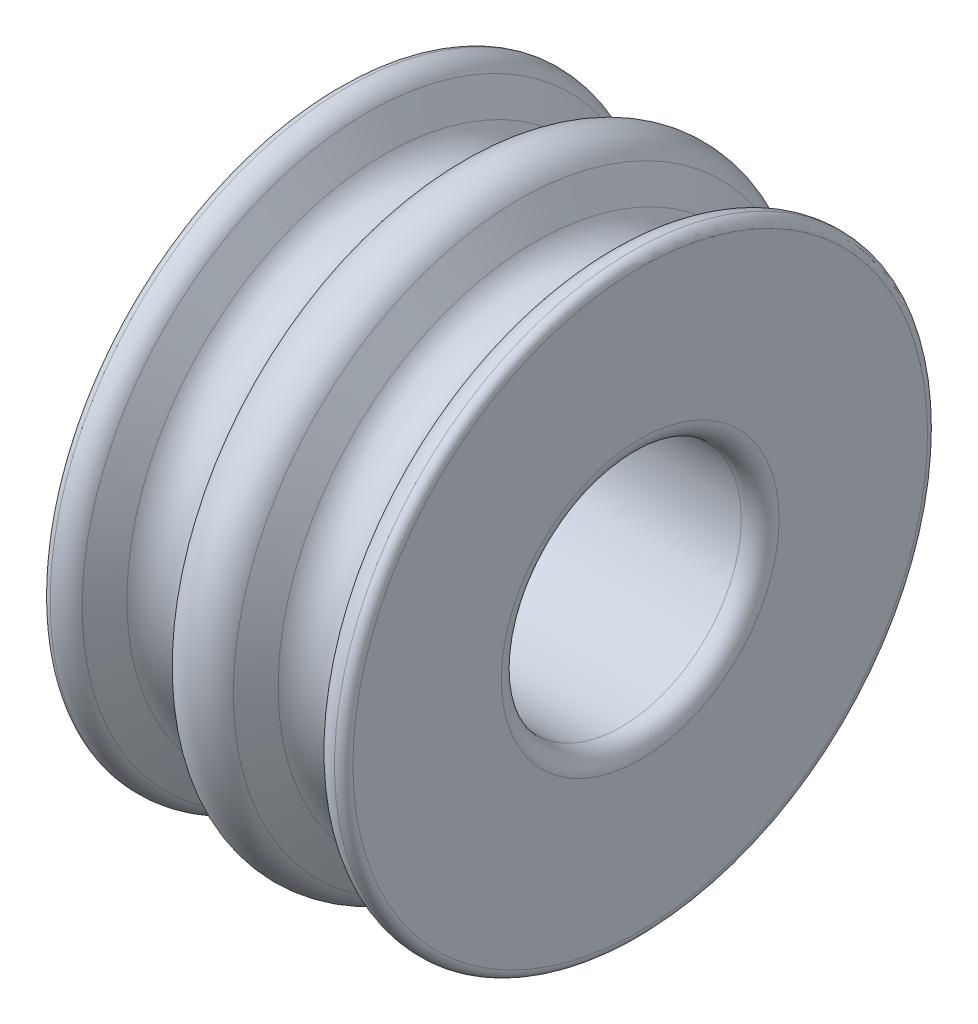
ISO-10303-21;
HEADER;
FILE_DESCRIPTION(('STEP AP214'),'2;1');
FILE_NAME('part.step','',(''),(''),'','','');
FILE_SCHEMA(('AUTOMOTIVE_DESIGN { 1 0 10303 214 1 1 1 1 }'));
ENDSEC;
DATA;
#1=APPLICATION_CONTEXT('core data for automotive mechanical design processes');
#2=APPLICATION_PROTOCOL_DEFINITION('international standard','automotive_design',2000,#1);
#3=PRODUCT_CONTEXT('',#1,'mechanical');
#4=PRODUCT('Part','Part','',(#3));
#5=PRODUCT_RELATED_PRODUCT_CATEGORY('part','',(#4));
#6=PRODUCT_DEFINITION_FORMATION('','',#4);
#7=PRODUCT_DEFINITION_CONTEXT('part definition',#1,'design');
#8=PRODUCT_DEFINITION('design','',#6,#7);
#9=PRODUCT_DEFINITION_SHAPE('','',#8);
#10=(LENGTH_UNIT() NAMED_UNIT(*) SI_UNIT(.MILLI.,.METRE.));
#11=(NAMED_UNIT(*) PLANE_ANGLE_UNIT() SI_UNIT($,.RADIAN.));
#12=(NAMED_UNIT(*) SI_UNIT($,.STERADIAN.) SOLID_ANGLE_UNIT());
#13=UNCERTAINTY_MEASURE_WITH_UNIT(LENGTH_MEASURE(1.E-05),#10,'distance_accuracy_value','');
#14=(GEOMETRIC_REPRESENTATION_CONTEXT(3) GLOBAL_UNCERTAINTY_ASSIGNED_CONTEXT((#13)) GLOBAL_UNIT_ASSIGNED_CONTEXT((#10,
#11,#12)) REPRESENTATION_CONTEXT('',''));
#15=CARTESIAN_POINT('',(0.,0.,0.));
#16=DIRECTION('',(0.,0.,1.));
#17=DIRECTION('',(1.,0.,0.));
#18=AXIS2_PLACEMENT_3D('',#15,#16,#17);
#19=CARTESIAN_POINT('',(0.,0.,0.));
#20=DIRECTION('',(1.,0.,0.));
#21=DIRECTION('',(0.,0.,-1.));
#22=AXIS2_PLACEMENT_3D('',#19,#20,#21);
#23=TOROIDAL_SURFACE('',#22,14.1925947136558,1.81781012862925);
#24=CARTESIAN_POINT('',(1.57426975064959,0.,0.));
#25=DIRECTION('',(1.,0.,0.));
#26=DIRECTION('',(0.,0.,-1.));
#27=AXIS2_PLACEMENT_3D('',#24,#25,#26);
#28=CIRCLE('',#27,15.1014997779704);
#29=CARTESIAN_POINT('',(1.57426975064959,0.,-15.1014997779704));
#30=VERTEX_POINT('',#29);
#31=EDGE_CURVE('E105',#30,#30,#28,.T.);
#32=ORIENTED_EDGE('',*,*,#31,.F.);
#33=EDGE_LOOP('',(#32));
#34=FACE_BOUND('',#33,.T.);
#35=CARTESIAN_POINT('',(-1.57426975064959,0.,0.));
#36=DIRECTION('',(1.,0.,0.));
#37=DIRECTION('',(0.,0.,-1.));
#38=AXIS2_PLACEMENT_3D('',#35,#36,#37);
#39=CIRCLE('',#38,15.1014997779704);
#40=CARTESIAN_POINT('',(-1.57426975064959,0.,-15.1014997779704));
#41=VERTEX_POINT('',#40);
#42=EDGE_CURVE('E61',#41,#41,#39,.T.);
#43=ORIENTED_EDGE('',*,*,#42,.T.);
#44=EDGE_LOOP('',(#43));
#45=FACE_BOUND('',#44,.T.);
#46=ADVANCED_FACE('F37',(#34,#45),#23,.T.);
#47=CARTESIAN_POINT('',(-2.44116209087946,0.,0.));
#48=DIRECTION('',(1.,0.,0.));
#49=DIRECTION('',(0.,0.,-1.));
#50=AXIS2_PLACEMENT_3D('',#47,#48,#49);
#51=CONICAL_SURFACE('',#50,13.5999982,1.0471975511966);
#52=ORIENTED_EDGE('',*,*,#42,.F.);
#53=EDGE_LOOP('',(#52));
#54=FACE_BOUND('',#53,.T.);
#55=CARTESIAN_POINT('',(-2.44116209087946,0.,0.));
#56=DIRECTION('',(1.,0.,0.));
#57=DIRECTION('',(0.,0.,-1.));
#58=AXIS2_PLACEMENT_3D('',#55,#56,#57);
#59=CIRCLE('',#58,13.5999982);
#60=CARTESIAN_POINT('',(-2.44116209087946,0.,-13.5999982));
#61=VERTEX_POINT('',#60);
#62=EDGE_CURVE('E65',#61,#61,#59,.T.);
#63=ORIENTED_EDGE('',*,*,#62,.T.);
#64=EDGE_LOOP('',(#63));
#65=FACE_BOUND('',#64,.T.);
#66=ADVANCED_FACE('F115',(#54,#65),#51,.T.);
#67=CARTESIAN_POINT('',(-4.0000047,0.,0.));
#68=DIRECTION('',(1.,0.,0.));
#69=DIRECTION('',(0.,0.,-1.));
#70=AXIS2_PLACEMENT_3D('',#67,#68,#69);
#71=TOROIDAL_SURFACE('',#70,14.4999964,1.7999964);
#72=ORIENTED_EDGE('',*,*,#62,.F.);
#73=EDGE_LOOP('',(#72));
#74=FACE_BOUND('',#73,.T.);
#75=CARTESIAN_POINT('',(-5.55884730912053,0.,0.));
#76=DIRECTION('',(1.,0.,0.));
#77=DIRECTION('',(0.,0.,-1.));
#78=AXIS2_PLACEMENT_3D('',#75,#76,#77);
#79=CIRCLE('',#78,13.5999982);
#80=CARTESIAN_POINT('',(-5.55884730912053,0.,-13.5999982));
#81=VERTEX_POINT('',#80);
#82=EDGE_CURVE('E69',#81,#81,#79,.T.);
#83=ORIENTED_EDGE('',*,*,#82,.T.);
#84=EDGE_LOOP('',(#83));
#85=FACE_BOUND('',#84,.T.);
#86=ADVANCED_FACE('F121',(#74,#85),#71,.F.);
#87=CARTESIAN_POINT('',(-6.4257396493504,0.,0.));
#88=DIRECTION('',(-1.,0.,0.));
#89=DIRECTION('',(0.,0.,1.));
#90=AXIS2_PLACEMENT_3D('',#87,#88,#89);
#91=CONICAL_SURFACE('',#90,15.1014997779704,1.0471975511966);
#92=ORIENTED_EDGE('',*,*,#82,.F.);
#93=EDGE_LOOP('',(#92));
#94=FACE_BOUND('',#93,.T.);
#95=CARTESIAN_POINT('',(-6.4257396493504,0.,0.));
#96=DIRECTION('',(1.,0.,0.));
#97=DIRECTION('',(0.,0.,-1.));
#98=AXIS2_PLACEMENT_3D('',#95,#96,#97);
#99=CIRCLE('',#98,15.1014997779704);
#100=CARTESIAN_POINT('',(-6.4257396493504,0.,-15.1014997779704));
#101=VERTEX_POINT('',#100);
#102=EDGE_CURVE('E73',#101,#101,#99,.T.);
#103=ORIENTED_EDGE('',*,*,#102,.T.);
#104=EDGE_LOOP('',(#103));
#105=FACE_BOUND('',#104,.T.);
#106=ADVANCED_FACE('F127',(#94,#105),#91,.T.);
#107=CARTESIAN_POINT('',(-7.46496805543077,0.,0.));
#108=DIRECTION('',(1.,0.,0.));
#109=DIRECTION('',(0.,0.,-1.));
#110=AXIS2_PLACEMENT_3D('',#107,#108,#109);
#111=TOROIDAL_SURFACE('',#110,14.5015009779704,1.19999760000001);
#112=ORIENTED_EDGE('',*,*,#102,.F.);
#113=EDGE_LOOP('',(#112));
#114=FACE_BOUND('',#113,.T.);
#115=CARTESIAN_POINT('',(-7.52504064612088,0.,0.));
#116=DIRECTION('',(1.,0.,0.));
#117=DIRECTION('',(0.,0.,-1.));
#118=AXIS2_PLACEMENT_3D('',#115,#116,#117);
#119=CIRCLE('',#118,15.699994);
#120=CARTESIAN_POINT('',(-7.52504064612088,0.,-15.699994));
#121=VERTEX_POINT('',#120);
#122=EDGE_CURVE('E77',#121,#121,#119,.T.);
#123=ORIENTED_EDGE('',*,*,#122,.T.);
#124=EDGE_LOOP('',(#123));
#125=FACE_BOUND('',#124,.T.);
#126=ADVANCED_FACE('F133',(#114,#125),#111,.T.);
#127=CARTESIAN_POINT('',(-7.5000104,0.,0.));
#128=DIRECTION('',(1.,0.,0.));
#129=DIRECTION('',(0.,0.,-1.));
#130=AXIS2_PLACEMENT_3D('',#127,#128,#129);
#131=TOROIDAL_SURFACE('',#130,15.2006219074877,0.499999);
#132=ORIENTED_EDGE('',*,*,#122,.F.);
#133=EDGE_LOOP('',(#132));
#134=FACE_BOUND('',#133,.T.);
#135=CARTESIAN_POINT('',(-8.0000094,0.,0.));
#136=DIRECTION('',(1.,0.,0.));
#137=DIRECTION('',(0.,0.,-1.));
#138=AXIS2_PLACEMENT_3D('',#135,#136,#137);
#139=CIRCLE('',#138,15.2006219074877);
#140=CARTESIAN_POINT('',(-8.0000094,0.,-15.2006219074877));
#141=VERTEX_POINT('',#140);
#142=EDGE_CURVE('E81',#141,#141,#139,.T.);
#143=ORIENTED_EDGE('',*,*,#142,.T.);
#144=EDGE_LOOP('',(#143));
#145=FACE_BOUND('',#144,.T.);
#146=ADVANCED_FACE('F139',(#134,#145),#131,.T.);
#147=CARTESIAN_POINT('',(-8.0000094,0.,0.));
#148=DIRECTION('',(1.,0.,0.));
#149=DIRECTION('',(0.,0.,-1.));
#150=AXIS2_PLACEMENT_3D('',#147,#148,#149);
#151=PLANE('',#150);
#152=CARTESIAN_POINT('',(-8.0000094,0.,0.));
#153=DIRECTION('',(1.,0.,0.));
#154=DIRECTION('',(0.,0.,-1.));
#155=AXIS2_PLACEMENT_3D('',#152,#153,#154);
#156=CIRCLE('',#155,7.350000032);
#157=CARTESIAN_POINT('',(-8.0000094,0.,-7.350000032));
#158=VERTEX_POINT('',#157);
#159=EDGE_CURVE('E55',#158,#158,#156,.T.);
#160=ORIENTED_EDGE('',*,*,#159,.T.);
#161=EDGE_LOOP('',(#160));
#162=FACE_BOUND('',#161,.T.);
#163=ORIENTED_EDGE('',*,*,#142,.F.);
#164=EDGE_LOOP('',(#163));
#165=FACE_BOUND('',#164,.T.);
#166=ADVANCED_FACE('F145',(#162,#165),#151,.F.);
#167=CARTESIAN_POINT('',(8.0000094,0.,0.));
#168=DIRECTION('',(1.,0.,0.));
#169=DIRECTION('',(0.,0.,-1.));
#170=AXIS2_PLACEMENT_3D('',#167,#168,#169);
#171=PLANE('',#170);
#172=CARTESIAN_POINT('',(8.0000094,0.,0.));
#173=DIRECTION('',(1.,0.,0.));
#174=DIRECTION('',(0.,0.,-1.));
#175=AXIS2_PLACEMENT_3D('',#172,#173,#174);
#176=CIRCLE('',#175,7.350000032);
#177=CARTESIAN_POINT('',(8.0000094,0.,-7.350000032));
#178=VERTEX_POINT('',#177);
#179=EDGE_CURVE('E10',#178,#178,#176,.F.);
#180=ORIENTED_EDGE('',*,*,#179,.T.);
#181=EDGE_LOOP('',(#180));
#182=FACE_BOUND('',#181,.T.);
#183=CARTESIAN_POINT('',(8.0000094,0.,0.));
#184=DIRECTION('',(1.,0.,0.));
#185=DIRECTION('',(0.,0.,-1.));
#186=AXIS2_PLACEMENT_3D('',#183,#184,#185);
#187=CIRCLE('',#186,15.2006219074877);
#188=CARTESIAN_POINT('',(8.0000094,0.,-15.2006219074877));
#189=VERTEX_POINT('',#188);
#190=EDGE_CURVE('E85',#189,#189,#187,.T.);
#191=ORIENTED_EDGE('',*,*,#190,.T.);
#192=EDGE_LOOP('',(#191));
#193=FACE_BOUND('',#192,.T.);
#194=ADVANCED_FACE('F150',(#182,#193),#171,.T.);
#195=CARTESIAN_POINT('',(7.5000104,0.,0.));
#196=DIRECTION('',(1.,0.,0.));
#197=DIRECTION('',(0.,0.,-1.));
#198=AXIS2_PLACEMENT_3D('',#195,#196,#197);
#199=TOROIDAL_SURFACE('',#198,15.2006219074877,0.499999);
#200=CARTESIAN_POINT('',(7.52504064612088,0.,0.));
#201=DIRECTION('',(1.,0.,0.));
#202=DIRECTION('',(0.,0.,-1.));
#203=AXIS2_PLACEMENT_3D('',#200,#201,#202);
#204=CIRCLE('',#203,15.699994);
#205=CARTESIAN_POINT('',(7.52504064612088,0.,-15.699994));
#206=VERTEX_POINT('',#205);
#207=EDGE_CURVE('E89',#206,#206,#204,.T.);
#208=ORIENTED_EDGE('',*,*,#207,.T.);
#209=EDGE_LOOP('',(#208));
#210=FACE_BOUND('',#209,.T.);
#211=ORIENTED_EDGE('',*,*,#190,.F.);
#212=EDGE_LOOP('',(#211));
#213=FACE_BOUND('',#212,.T.);
#214=ADVANCED_FACE('F156',(#210,#213),#199,.T.);
#215=CARTESIAN_POINT('',(7.46496805543077,0.,0.));
#216=DIRECTION('',(1.,0.,0.));
#217=DIRECTION('',(0.,0.,-1.));
#218=AXIS2_PLACEMENT_3D('',#215,#216,#217);
#219=TOROIDAL_SURFACE('',#218,14.5015009779704,1.1999976);
#220=CARTESIAN_POINT('',(6.42573964935041,0.,0.));
#221=DIRECTION('',(1.,0.,0.));
#222=DIRECTION('',(0.,0.,-1.));
#223=AXIS2_PLACEMENT_3D('',#220,#221,#222);
#224=CIRCLE('',#223,15.1014997779704);
#225=CARTESIAN_POINT('',(6.42573964935041,0.,-15.1014997779704));
#226=VERTEX_POINT('',#225);
#227=EDGE_CURVE('E93',#226,#226,#224,.T.);
#228=ORIENTED_EDGE('',*,*,#227,.T.);
#229=EDGE_LOOP('',(#228));
#230=FACE_BOUND('',#229,.T.);
#231=ORIENTED_EDGE('',*,*,#207,.F.);
#232=EDGE_LOOP('',(#231));
#233=FACE_BOUND('',#232,.T.);
#234=ADVANCED_FACE('F184',(#230,#233),#219,.T.);
#235=CARTESIAN_POINT('',(6.42573964935041,0.,0.));
#236=DIRECTION('',(1.,0.,0.));
#237=DIRECTION('',(0.,0.,-1.));
#238=AXIS2_PLACEMENT_3D('',#235,#236,#237);
#239=CONICAL_SURFACE('',#238,15.1014997779704,1.0471975511966);
#240=CARTESIAN_POINT('',(5.55884730912054,0.,0.));
#241=DIRECTION('',(1.,0.,0.));
#242=DIRECTION('',(0.,0.,-1.));
#243=AXIS2_PLACEMENT_3D('',#240,#241,#242);
#244=CIRCLE('',#243,13.5999982);
#245=CARTESIAN_POINT('',(5.55884730912054,0.,-13.5999982));
#246=VERTEX_POINT('',#245);
#247=EDGE_CURVE('E97',#246,#246,#244,.T.);
#248=ORIENTED_EDGE('',*,*,#247,.T.);
#249=EDGE_LOOP('',(#248));
#250=FACE_BOUND('',#249,.T.);
#251=ORIENTED_EDGE('',*,*,#227,.F.);
#252=EDGE_LOOP('',(#251));
#253=FACE_BOUND('',#252,.T.);
#254=ADVANCED_FACE('F180',(#250,#253),#239,.T.);
#255=CARTESIAN_POINT('',(4.0000047,0.,0.));
#256=DIRECTION('',(1.,0.,0.));
#257=DIRECTION('',(0.,0.,-1.));
#258=AXIS2_PLACEMENT_3D('',#255,#256,#257);
#259=TOROIDAL_SURFACE('',#258,14.4999964,1.7999964);
#260=CARTESIAN_POINT('',(2.44116209087946,0.,0.));
#261=DIRECTION('',(1.,0.,0.));
#262=DIRECTION('',(0.,0.,-1.));
#263=AXIS2_PLACEMENT_3D('',#260,#261,#262);
#264=CIRCLE('',#263,13.5999982);
#265=CARTESIAN_POINT('',(2.44116209087946,0.,-13.5999982));
#266=VERTEX_POINT('',#265);
#267=EDGE_CURVE('E101',#266,#266,#264,.T.);
#268=ORIENTED_EDGE('',*,*,#267,.T.);
#269=EDGE_LOOP('',(#268));
#270=FACE_BOUND('',#269,.T.);
#271=ORIENTED_EDGE('',*,*,#247,.F.);
#272=EDGE_LOOP('',(#271));
#273=FACE_BOUND('',#272,.T.);
#274=ADVANCED_FACE('F174',(#270,#273),#259,.F.);
#275=CARTESIAN_POINT('',(2.44116209087946,0.,0.));
#276=DIRECTION('',(-1.,0.,0.));
#277=DIRECTION('',(0.,0.,1.));
#278=AXIS2_PLACEMENT_3D('',#275,#276,#277);
#279=CONICAL_SURFACE('',#278,13.5999982,1.0471975511966);
#280=ORIENTED_EDGE('',*,*,#31,.T.);
#281=EDGE_LOOP('',(#280));
#282=FACE_BOUND('',#281,.T.);
#283=ORIENTED_EDGE('',*,*,#267,.F.);
#284=EDGE_LOOP('',(#283));
#285=FACE_BOUND('',#284,.T.);
#286=ADVANCED_FACE('F110',(#282,#285),#279,.T.);
#287=CARTESIAN_POINT('',(-8.0000094,0.,0.));
#288=DIRECTION('',(1.,0.,0.));
#289=DIRECTION('',(0.,0.,-1.));
#290=AXIS2_PLACEMENT_3D('',#287,#288,#289);
#291=CYLINDRICAL_SURFACE('',#290,6.35);
#292=CARTESIAN_POINT('',(-7.000009368,0.,0.));
#293=DIRECTION('',(1.,0.,0.));
#294=DIRECTION('',(0.,0.,-1.));
#295=AXIS2_PLACEMENT_3D('',#292,#293,#294);
#296=CIRCLE('',#295,6.35);
#297=CARTESIAN_POINT('',(-7.000009368,0.,-6.35));
#298=VERTEX_POINT('',#297);
#299=EDGE_CURVE('E45',#298,#298,#296,.F.);
#300=ORIENTED_EDGE('',*,*,#299,.T.);
#301=EDGE_LOOP('',(#300));
#302=FACE_BOUND('',#301,.T.);
#303=CARTESIAN_POINT('',(7.000009368,0.,0.));
#304=DIRECTION('',(1.,0.,0.));
#305=DIRECTION('',(0.,0.,-1.));
#306=AXIS2_PLACEMENT_3D('',#303,#304,#305);
#307=CIRCLE('',#306,6.35);
#308=CARTESIAN_POINT('',(7.000009368,0.,-6.35));
#309=VERTEX_POINT('',#308);
#310=EDGE_CURVE('E50',#309,#309,#307,.T.);
#311=ORIENTED_EDGE('',*,*,#310,.T.);
#312=EDGE_LOOP('',(#311));
#313=FACE_BOUND('',#312,.T.);
#314=ADVANCED_FACE('F161',(#302,#313),#291,.F.);
#315=CARTESIAN_POINT('',(-7.000009368,0.,0.));
#316=DIRECTION('',(1.,0.,0.));
#317=DIRECTION('',(0.,0.,-1.));
#318=AXIS2_PLACEMENT_3D('',#315,#316,#317);
#319=TOROIDAL_SURFACE('',#318,7.350000032,1.000000032);
#320=ORIENTED_EDGE('',*,*,#299,.F.);
#321=EDGE_LOOP('',(#320));
#322=FACE_BOUND('',#321,.T.);
#323=ORIENTED_EDGE('',*,*,#159,.F.);
#324=EDGE_LOOP('',(#323));
#325=FACE_BOUND('',#324,.T.);
#326=ADVANCED_FACE('F159',(#322,#325),#319,.T.);
#327=CARTESIAN_POINT('',(7.000009368,0.,0.));
#328=DIRECTION('',(1.,0.,0.));
#329=DIRECTION('',(0.,0.,-1.));
#330=AXIS2_PLACEMENT_3D('',#327,#328,#329);
#331=TOROIDAL_SURFACE('',#330,7.350000032,1.000000032);
#332=ORIENTED_EDGE('',*,*,#179,.F.);
#333=EDGE_LOOP('',(#332));
#334=FACE_BOUND('',#333,.T.);
#335=ORIENTED_EDGE('',*,*,#310,.F.);
#336=EDGE_LOOP('',(#335));
#337=FACE_BOUND('',#336,.T.);
#338=ADVANCED_FACE('F39',(#334,#337),#331,.T.);
#339=CLOSED_SHELL('',(#46,#66,#86,#106,#126,#146,#166,#194,#214,#234,#254,#274,#286,#314,#326,#338));
#340=MANIFOLD_SOLID_BREP('B2',#339);
#341=ADVANCED_BREP_SHAPE_REPRESENTATION('',(#18,#340),#14);
#342=SHAPE_DEFINITION_REPRESENTATION(#9,#341);
ENDSEC;
END-ISO-10303-21;
